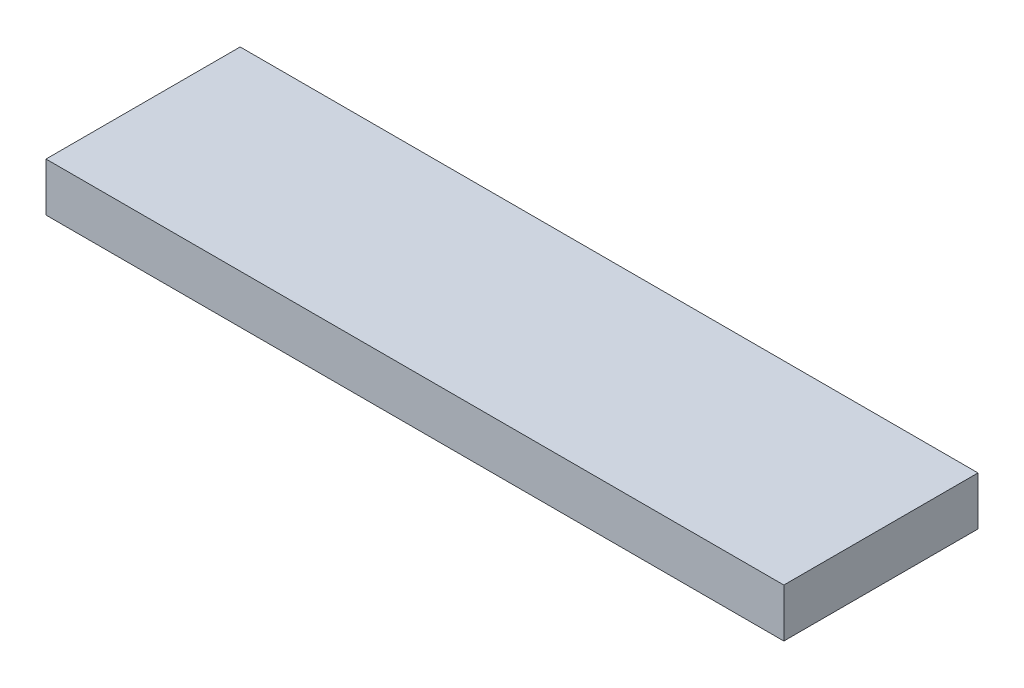
ISO-10303-21;
HEADER;
FILE_DESCRIPTION(('STEP AP214'),'2;1');
FILE_NAME('part.step','',(''),(''),'','','');
FILE_SCHEMA(('AUTOMOTIVE_DESIGN { 1 0 10303 214 1 1 1 1 }'));
ENDSEC;
DATA;
#1=APPLICATION_CONTEXT('core data for automotive mechanical design processes');
#2=APPLICATION_PROTOCOL_DEFINITION('international standard','automotive_design',2000,#1);
#3=PRODUCT_CONTEXT('',#1,'mechanical');
#4=PRODUCT('Part','Part','',(#3));
#5=PRODUCT_RELATED_PRODUCT_CATEGORY('part','',(#4));
#6=PRODUCT_DEFINITION_FORMATION('','',#4);
#7=PRODUCT_DEFINITION_CONTEXT('part definition',#1,'design');
#8=PRODUCT_DEFINITION('design','',#6,#7);
#9=PRODUCT_DEFINITION_SHAPE('','',#8);
#10=(LENGTH_UNIT() NAMED_UNIT(*) SI_UNIT(.MILLI.,.METRE.));
#11=(NAMED_UNIT(*) PLANE_ANGLE_UNIT() SI_UNIT($,.RADIAN.));
#12=(NAMED_UNIT(*) SI_UNIT($,.STERADIAN.) SOLID_ANGLE_UNIT());
#13=UNCERTAINTY_MEASURE_WITH_UNIT(LENGTH_MEASURE(1.E-05),#10,'distance_accuracy_value','');
#14=(GEOMETRIC_REPRESENTATION_CONTEXT(3) GLOBAL_UNCERTAINTY_ASSIGNED_CONTEXT((#13)) GLOBAL_UNIT_ASSIGNED_CONTEXT((#10,
#11,#12)) REPRESENTATION_CONTEXT('',''));
#15=CARTESIAN_POINT('',(0.,0.,0.));
#16=DIRECTION('',(0.,0.,1.));
#17=DIRECTION('',(1.,0.,0.));
#18=AXIS2_PLACEMENT_3D('',#15,#16,#17);
#19=CARTESIAN_POINT('',(-24.13,3.175,-6.35));
#20=DIRECTION('',(1.,0.,0.));
#21=DIRECTION('',(0.,0.,-1.));
#22=AXIS2_PLACEMENT_3D('',#19,#20,#21);
#23=PLANE('',#22);
#24=DIRECTION('',(0.,0.,1.));
#25=VECTOR('',#24,1.);
#26=CARTESIAN_POINT('',(-24.13,0.,-6.35));
#27=LINE('',#26,#25);
#28=CARTESIAN_POINT('',(-24.13,0.,-6.35));
#29=VERTEX_POINT('',#28);
#30=CARTESIAN_POINT('',(-24.13,0.,6.35));
#31=VERTEX_POINT('',#30);
#32=EDGE_CURVE('E96',#29,#31,#27,.T.);
#33=ORIENTED_EDGE('',*,*,#32,.T.);
#34=DIRECTION('',(0.,-1.,0.));
#35=VECTOR('',#34,1.);
#36=CARTESIAN_POINT('',(-24.13,3.175,6.35));
#37=LINE('',#36,#35);
#38=CARTESIAN_POINT('',(-24.13,3.175,6.35));
#39=VERTEX_POINT('',#38);
#40=EDGE_CURVE('E11',#39,#31,#37,.T.);
#41=ORIENTED_EDGE('',*,*,#40,.F.);
#42=DIRECTION('',(0.,0.,1.));
#43=VECTOR('',#42,1.);
#44=CARTESIAN_POINT('',(-24.13,3.175,-6.35));
#45=LINE('',#44,#43);
#46=CARTESIAN_POINT('',(-24.13,3.175,-6.35));
#47=VERTEX_POINT('',#46);
#48=EDGE_CURVE('E84',#47,#39,#45,.T.);
#49=ORIENTED_EDGE('',*,*,#48,.F.);
#50=DIRECTION('',(0.,-1.,0.));
#51=VECTOR('',#50,1.);
#52=CARTESIAN_POINT('',(-24.13,3.175,-6.35));
#53=LINE('',#52,#51);
#54=EDGE_CURVE('E92',#47,#29,#53,.T.);
#55=ORIENTED_EDGE('',*,*,#54,.T.);
#56=EDGE_LOOP('',(#33,#41,#49,#55));
#57=FACE_BOUND('',#56,.T.);
#58=ADVANCED_FACE('F33',(#57),#23,.F.);
#59=CARTESIAN_POINT('',(-24.13,3.175,6.35));
#60=DIRECTION('',(0.,0.,-1.));
#61=DIRECTION('',(-1.,0.,0.));
#62=AXIS2_PLACEMENT_3D('',#59,#60,#61);
#63=PLANE('',#62);
#64=DIRECTION('',(1.,0.,0.));
#65=VECTOR('',#64,1.);
#66=CARTESIAN_POINT('',(-24.13,0.,6.35));
#67=LINE('',#66,#65);
#68=CARTESIAN_POINT('',(24.13,0.,6.35));
#69=VERTEX_POINT('',#68);
#70=EDGE_CURVE('E88',#31,#69,#67,.T.);
#71=ORIENTED_EDGE('',*,*,#70,.T.);
#72=DIRECTION('',(0.,-1.,0.));
#73=VECTOR('',#72,1.);
#74=CARTESIAN_POINT('',(24.13,3.175,6.35));
#75=LINE('',#74,#73);
#76=CARTESIAN_POINT('',(24.13,3.175,6.35));
#77=VERTEX_POINT('',#76);
#78=EDGE_CURVE('E41',#77,#69,#75,.T.);
#79=ORIENTED_EDGE('',*,*,#78,.F.);
#80=DIRECTION('',(1.,0.,0.));
#81=VECTOR('',#80,1.);
#82=CARTESIAN_POINT('',(-24.13,3.175,6.35));
#83=LINE('',#82,#81);
#84=EDGE_CURVE('E79',#39,#77,#83,.T.);
#85=ORIENTED_EDGE('',*,*,#84,.F.);
#86=ORIENTED_EDGE('',*,*,#40,.T.);
#87=EDGE_LOOP('',(#71,#79,#85,#86));
#88=FACE_BOUND('',#87,.T.);
#89=ADVANCED_FACE('F87',(#88),#63,.F.);
#90=CARTESIAN_POINT('',(24.13,3.175,-6.35));
#91=DIRECTION('',(-1.,0.,0.));
#92=DIRECTION('',(0.,0.,1.));
#93=AXIS2_PLACEMENT_3D('',#90,#91,#92);
#94=PLANE('',#93);
#95=DIRECTION('',(0.,0.,-1.));
#96=VECTOR('',#95,1.);
#97=CARTESIAN_POINT('',(24.13,0.,-6.35));
#98=LINE('',#97,#96);
#99=CARTESIAN_POINT('',(24.13,0.,-6.35));
#100=VERTEX_POINT('',#99);
#101=EDGE_CURVE('E66',#69,#100,#98,.T.);
#102=ORIENTED_EDGE('',*,*,#101,.T.);
#103=DIRECTION('',(0.,-1.,0.));
#104=VECTOR('',#103,1.);
#105=CARTESIAN_POINT('',(24.13,3.175,-6.35));
#106=LINE('',#105,#104);
#107=CARTESIAN_POINT('',(24.13,3.175,-6.35));
#108=VERTEX_POINT('',#107);
#109=EDGE_CURVE('E89',#108,#100,#106,.T.);
#110=ORIENTED_EDGE('',*,*,#109,.F.);
#111=DIRECTION('',(0.,0.,-1.));
#112=VECTOR('',#111,1.);
#113=CARTESIAN_POINT('',(24.13,3.175,-6.35));
#114=LINE('',#113,#112);
#115=EDGE_CURVE('E82',#77,#108,#114,.T.);
#116=ORIENTED_EDGE('',*,*,#115,.F.);
#117=ORIENTED_EDGE('',*,*,#78,.T.);
#118=EDGE_LOOP('',(#102,#110,#116,#117));
#119=FACE_BOUND('',#118,.T.);
#120=ADVANCED_FACE('F90',(#119),#94,.F.);
#121=CARTESIAN_POINT('',(-24.13,3.175,-6.35));
#122=DIRECTION('',(0.,0.,1.));
#123=DIRECTION('',(1.,0.,0.));
#124=AXIS2_PLACEMENT_3D('',#121,#122,#123);
#125=PLANE('',#124);
#126=DIRECTION('',(-1.,0.,0.));
#127=VECTOR('',#126,1.);
#128=CARTESIAN_POINT('',(-24.13,0.,-6.35));
#129=LINE('',#128,#127);
#130=EDGE_CURVE('E72',#100,#29,#129,.T.);
#131=ORIENTED_EDGE('',*,*,#130,.T.);
#132=ORIENTED_EDGE('',*,*,#54,.F.);
#133=DIRECTION('',(-1.,0.,0.));
#134=VECTOR('',#133,1.);
#135=CARTESIAN_POINT('',(-24.13,3.175,-6.35));
#136=LINE('',#135,#134);
#137=EDGE_CURVE('E49',#108,#47,#136,.T.);
#138=ORIENTED_EDGE('',*,*,#137,.F.);
#139=ORIENTED_EDGE('',*,*,#109,.T.);
#140=EDGE_LOOP('',(#131,#132,#138,#139));
#141=FACE_BOUND('',#140,.T.);
#142=ADVANCED_FACE('F103',(#141),#125,.F.);
#143=CARTESIAN_POINT('',(0.,3.175,0.));
#144=DIRECTION('',(0.,1.,0.));
#145=DIRECTION('',(0.,0.,1.));
#146=AXIS2_PLACEMENT_3D('',#143,#144,#145);
#147=PLANE('',#146);
#148=ORIENTED_EDGE('',*,*,#48,.T.);
#149=ORIENTED_EDGE('',*,*,#84,.T.);
#150=ORIENTED_EDGE('',*,*,#115,.T.);
#151=ORIENTED_EDGE('',*,*,#137,.T.);
#152=EDGE_LOOP('',(#148,#149,#150,#151));
#153=FACE_BOUND('',#152,.T.);
#154=ADVANCED_FACE('F80',(#153),#147,.T.);
#155=CARTESIAN_POINT('',(0.,0.,0.));
#156=DIRECTION('',(0.,1.,0.));
#157=DIRECTION('',(0.,0.,1.));
#158=AXIS2_PLACEMENT_3D('',#155,#156,#157);
#159=PLANE('',#158);
#160=ORIENTED_EDGE('',*,*,#32,.F.);
#161=ORIENTED_EDGE('',*,*,#130,.F.);
#162=ORIENTED_EDGE('',*,*,#101,.F.);
#163=ORIENTED_EDGE('',*,*,#70,.F.);
#164=EDGE_LOOP('',(#160,#161,#162,#163));
#165=FACE_BOUND('',#164,.T.);
#166=ADVANCED_FACE('F106',(#165),#159,.F.);
#167=CLOSED_SHELL('',(#58,#89,#120,#142,#154,#166));
#168=MANIFOLD_SOLID_BREP('B2',#167);
#169=ADVANCED_BREP_SHAPE_REPRESENTATION('',(#18,#168),#14);
#170=SHAPE_DEFINITION_REPRESENTATION(#9,#169);
ENDSEC;
END-ISO-10303-21;
